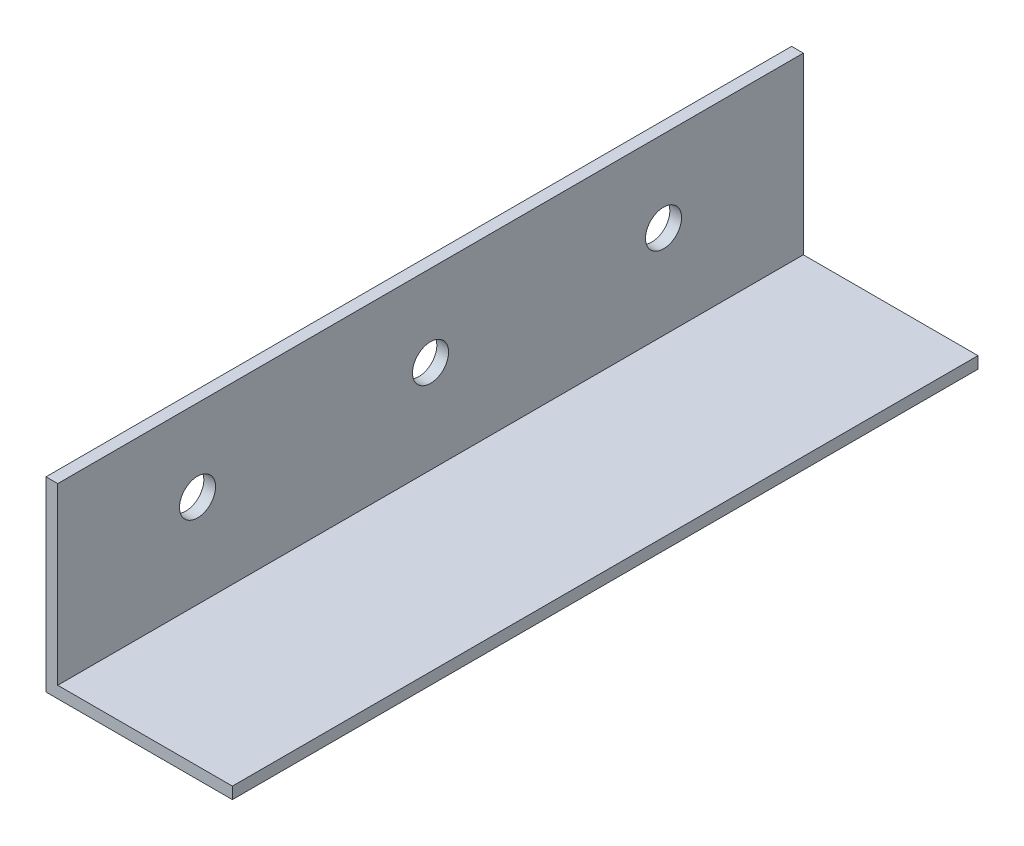
ISO-10303-21;
HEADER;
FILE_DESCRIPTION(('STEP AP214'),'2;1');
FILE_NAME('part.step','',(''),(''),'','','');
FILE_SCHEMA(('AUTOMOTIVE_DESIGN { 1 0 10303 214 1 1 1 1 }'));
ENDSEC;
DATA;
#1=APPLICATION_CONTEXT('core data for automotive mechanical design processes');
#2=APPLICATION_PROTOCOL_DEFINITION('international standard','automotive_design',2000,#1);
#3=PRODUCT_CONTEXT('',#1,'mechanical');
#4=PRODUCT('Part','Part','',(#3));
#5=PRODUCT_RELATED_PRODUCT_CATEGORY('part','',(#4));
#6=PRODUCT_DEFINITION_FORMATION('','',#4);
#7=PRODUCT_DEFINITION_CONTEXT('part definition',#1,'design');
#8=PRODUCT_DEFINITION('design','',#6,#7);
#9=PRODUCT_DEFINITION_SHAPE('','',#8);
#10=(LENGTH_UNIT() NAMED_UNIT(*) SI_UNIT(.MILLI.,.METRE.));
#11=(NAMED_UNIT(*) PLANE_ANGLE_UNIT() SI_UNIT($,.RADIAN.));
#12=(NAMED_UNIT(*) SI_UNIT($,.STERADIAN.) SOLID_ANGLE_UNIT());
#13=UNCERTAINTY_MEASURE_WITH_UNIT(LENGTH_MEASURE(1.E-05),#10,'distance_accuracy_value','');
#14=(GEOMETRIC_REPRESENTATION_CONTEXT(3) GLOBAL_UNCERTAINTY_ASSIGNED_CONTEXT((#13)) GLOBAL_UNIT_ASSIGNED_CONTEXT((#10,
#11,#12)) REPRESENTATION_CONTEXT('',''));
#15=CARTESIAN_POINT('',(0.,0.,0.));
#16=DIRECTION('',(0.,0.,1.));
#17=DIRECTION('',(1.,0.,0.));
#18=AXIS2_PLACEMENT_3D('',#15,#16,#17);
#19=CARTESIAN_POINT('',(0.,25.4,101.6));
#20=DIRECTION('',(0.,1.,0.));
#21=DIRECTION('',(0.,0.,1.));
#22=AXIS2_PLACEMENT_3D('',#19,#20,#21);
#23=PLANE('',#22);
#24=DIRECTION('',(1.,0.,0.));
#25=VECTOR('',#24,1.);
#26=CARTESIAN_POINT('',(0.,25.4,0.));
#27=LINE('',#26,#25);
#28=CARTESIAN_POINT('',(0.,25.4,0.));
#29=VERTEX_POINT('',#28);
#30=CARTESIAN_POINT('',(1.6002,25.4,0.));
#31=VERTEX_POINT('',#30);
#32=EDGE_CURVE('E117',#29,#31,#27,.T.);
#33=ORIENTED_EDGE('',*,*,#32,.F.);
#34=DIRECTION('',(0.,0.,-1.));
#35=VECTOR('',#34,1.);
#36=CARTESIAN_POINT('',(0.,25.4,101.6));
#37=LINE('',#36,#35);
#38=CARTESIAN_POINT('',(0.,25.4,101.6));
#39=VERTEX_POINT('',#38);
#40=EDGE_CURVE('E11',#39,#29,#37,.T.);
#41=ORIENTED_EDGE('',*,*,#40,.F.);
#42=DIRECTION('',(1.,0.,0.));
#43=VECTOR('',#42,1.);
#44=CARTESIAN_POINT('',(0.,25.4,101.6));
#45=LINE('',#44,#43);
#46=CARTESIAN_POINT('',(1.6002,25.4,101.6));
#47=VERTEX_POINT('',#46);
#48=EDGE_CURVE('E132',#39,#47,#45,.T.);
#49=ORIENTED_EDGE('',*,*,#48,.T.);
#50=DIRECTION('',(0.,0.,-1.));
#51=VECTOR('',#50,1.);
#52=CARTESIAN_POINT('',(1.6002,25.4,101.6));
#53=LINE('',#52,#51);
#54=EDGE_CURVE('E35',#47,#31,#53,.T.);
#55=ORIENTED_EDGE('',*,*,#54,.T.);
#56=EDGE_LOOP('',(#33,#41,#49,#55));
#57=FACE_BOUND('',#56,.T.);
#58=ADVANCED_FACE('F32',(#57),#23,.T.);
#59=CARTESIAN_POINT('',(0.,0.,101.6));
#60=DIRECTION('',(-1.,0.,0.));
#61=DIRECTION('',(0.,0.,1.));
#62=AXIS2_PLACEMENT_3D('',#59,#60,#61);
#63=PLANE('',#62);
#64=CARTESIAN_POINT('',(0.,14.2875,82.55));
#65=DIRECTION('',(1.,0.,0.));
#66=DIRECTION('',(0.,0.,-1.));
#67=AXIS2_PLACEMENT_3D('',#64,#65,#66);
#68=CIRCLE('',#67,2.45745);
#69=CARTESIAN_POINT('',(0.,14.2875,80.09255));
#70=VERTEX_POINT('',#69);
#71=EDGE_CURVE('E185',#70,#70,#68,.T.);
#72=ORIENTED_EDGE('',*,*,#71,.T.);
#73=EDGE_LOOP('',(#72));
#74=FACE_BOUND('',#73,.T.);
#75=CARTESIAN_POINT('',(0.,14.2875,50.8));
#76=DIRECTION('',(1.,0.,0.));
#77=DIRECTION('',(0.,0.,-1.));
#78=AXIS2_PLACEMENT_3D('',#75,#76,#77);
#79=CIRCLE('',#78,2.45745);
#80=CARTESIAN_POINT('',(0.,14.2875,48.34255));
#81=VERTEX_POINT('',#80);
#82=EDGE_CURVE('E176',#81,#81,#79,.T.);
#83=ORIENTED_EDGE('',*,*,#82,.T.);
#84=EDGE_LOOP('',(#83));
#85=FACE_BOUND('',#84,.T.);
#86=CARTESIAN_POINT('',(0.,14.2875,19.05));
#87=DIRECTION('',(1.,0.,0.));
#88=DIRECTION('',(0.,0.,-1.));
#89=AXIS2_PLACEMENT_3D('',#86,#87,#88);
#90=CIRCLE('',#89,2.45745);
#91=CARTESIAN_POINT('',(0.,14.2875,16.59255));
#92=VERTEX_POINT('',#91);
#93=EDGE_CURVE('E121',#92,#92,#90,.T.);
#94=ORIENTED_EDGE('',*,*,#93,.T.);
#95=EDGE_LOOP('',(#94));
#96=FACE_BOUND('',#95,.T.);
#97=DIRECTION('',(0.,1.,0.));
#98=VECTOR('',#97,1.);
#99=CARTESIAN_POINT('',(0.,0.,0.));
#100=LINE('',#99,#98);
#101=CARTESIAN_POINT('',(0.,0.,0.));
#102=VERTEX_POINT('',#101);
#103=EDGE_CURVE('E130',#102,#29,#100,.T.);
#104=ORIENTED_EDGE('',*,*,#103,.F.);
#105=DIRECTION('',(0.,0.,-1.));
#106=VECTOR('',#105,1.);
#107=CARTESIAN_POINT('',(0.,0.,101.6));
#108=LINE('',#107,#106);
#109=CARTESIAN_POINT('',(0.,0.,101.6));
#110=VERTEX_POINT('',#109);
#111=EDGE_CURVE('E41',#110,#102,#108,.T.);
#112=ORIENTED_EDGE('',*,*,#111,.F.);
#113=DIRECTION('',(0.,1.,0.));
#114=VECTOR('',#113,1.);
#115=CARTESIAN_POINT('',(0.,0.,101.6));
#116=LINE('',#115,#114);
#117=EDGE_CURVE('E107',#110,#39,#116,.T.);
#118=ORIENTED_EDGE('',*,*,#117,.T.);
#119=ORIENTED_EDGE('',*,*,#40,.T.);
#120=EDGE_LOOP('',(#104,#112,#118,#119));
#121=FACE_BOUND('',#120,.T.);
#122=ADVANCED_FACE('F140',(#74,#85,#96,#121),#63,.T.);
#123=CARTESIAN_POINT('',(25.4,0.,101.6));
#124=DIRECTION('',(0.,-1.,0.));
#125=DIRECTION('',(1.,0.,0.));
#126=AXIS2_PLACEMENT_3D('',#123,#124,#125);
#127=PLANE('',#126);
#128=DIRECTION('',(-1.,0.,0.));
#129=VECTOR('',#128,1.);
#130=CARTESIAN_POINT('',(25.4,0.,0.));
#131=LINE('',#130,#129);
#132=CARTESIAN_POINT('',(25.4,0.,0.));
#133=VERTEX_POINT('',#132);
#134=EDGE_CURVE('E94',#133,#102,#131,.T.);
#135=ORIENTED_EDGE('',*,*,#134,.F.);
#136=DIRECTION('',(0.,0.,-1.));
#137=VECTOR('',#136,1.);
#138=CARTESIAN_POINT('',(25.4,0.,101.6));
#139=LINE('',#138,#137);
#140=CARTESIAN_POINT('',(25.4,0.,101.6));
#141=VERTEX_POINT('',#140);
#142=EDGE_CURVE('E89',#141,#133,#139,.T.);
#143=ORIENTED_EDGE('',*,*,#142,.F.);
#144=DIRECTION('',(-1.,0.,0.));
#145=VECTOR('',#144,1.);
#146=CARTESIAN_POINT('',(25.4,0.,101.6));
#147=LINE('',#146,#145);
#148=EDGE_CURVE('E92',#141,#110,#147,.T.);
#149=ORIENTED_EDGE('',*,*,#148,.T.);
#150=ORIENTED_EDGE('',*,*,#111,.T.);
#151=EDGE_LOOP('',(#135,#143,#149,#150));
#152=FACE_BOUND('',#151,.T.);
#153=ADVANCED_FACE('F91',(#152),#127,.T.);
#154=CARTESIAN_POINT('',(25.4,1.6002,101.6));
#155=DIRECTION('',(1.,0.,0.));
#156=DIRECTION('',(0.,0.,-1.));
#157=AXIS2_PLACEMENT_3D('',#154,#155,#156);
#158=PLANE('',#157);
#159=DIRECTION('',(0.,-1.,0.));
#160=VECTOR('',#159,1.);
#161=CARTESIAN_POINT('',(25.4,1.6002,0.));
#162=LINE('',#161,#160);
#163=CARTESIAN_POINT('',(25.4,1.6002,0.));
#164=VERTEX_POINT('',#163);
#165=EDGE_CURVE('E127',#164,#133,#162,.T.);
#166=ORIENTED_EDGE('',*,*,#165,.F.);
#167=DIRECTION('',(0.,0.,-1.));
#168=VECTOR('',#167,1.);
#169=CARTESIAN_POINT('',(25.4,1.6002,101.6));
#170=LINE('',#169,#168);
#171=CARTESIAN_POINT('',(25.4,1.6002,101.6));
#172=VERTEX_POINT('',#171);
#173=EDGE_CURVE('E99',#172,#164,#170,.T.);
#174=ORIENTED_EDGE('',*,*,#173,.F.);
#175=DIRECTION('',(0.,-1.,0.));
#176=VECTOR('',#175,1.);
#177=CARTESIAN_POINT('',(25.4,1.6002,101.6));
#178=LINE('',#177,#176);
#179=EDGE_CURVE('E105',#172,#141,#178,.T.);
#180=ORIENTED_EDGE('',*,*,#179,.T.);
#181=ORIENTED_EDGE('',*,*,#142,.T.);
#182=EDGE_LOOP('',(#166,#174,#180,#181));
#183=FACE_BOUND('',#182,.T.);
#184=ADVANCED_FACE('F109',(#183),#158,.T.);
#185=CARTESIAN_POINT('',(1.6002,1.6002,101.6));
#186=DIRECTION('',(0.,1.,0.));
#187=DIRECTION('',(-1.,0.,0.));
#188=AXIS2_PLACEMENT_3D('',#185,#186,#187);
#189=PLANE('',#188);
#190=DIRECTION('',(1.,0.,0.));
#191=VECTOR('',#190,1.);
#192=CARTESIAN_POINT('',(1.6002,1.6002,0.));
#193=LINE('',#192,#191);
#194=CARTESIAN_POINT('',(1.6002,1.6002,0.));
#195=VERTEX_POINT('',#194);
#196=EDGE_CURVE('E124',#195,#164,#193,.T.);
#197=ORIENTED_EDGE('',*,*,#196,.F.);
#198=DIRECTION('',(0.,0.,-1.));
#199=VECTOR('',#198,1.);
#200=CARTESIAN_POINT('',(1.6002,1.6002,101.6));
#201=LINE('',#200,#199);
#202=CARTESIAN_POINT('',(1.6002,1.6002,101.6));
#203=VERTEX_POINT('',#202);
#204=EDGE_CURVE('E135',#203,#195,#201,.T.);
#205=ORIENTED_EDGE('',*,*,#204,.F.);
#206=DIRECTION('',(1.,0.,0.));
#207=VECTOR('',#206,1.);
#208=CARTESIAN_POINT('',(1.6002,1.6002,101.6));
#209=LINE('',#208,#207);
#210=EDGE_CURVE('E110',#203,#172,#209,.T.);
#211=ORIENTED_EDGE('',*,*,#210,.T.);
#212=ORIENTED_EDGE('',*,*,#173,.T.);
#213=EDGE_LOOP('',(#197,#205,#211,#212));
#214=FACE_BOUND('',#213,.T.);
#215=ADVANCED_FACE('F156',(#214),#189,.T.);
#216=CARTESIAN_POINT('',(1.6002,25.4,101.6));
#217=DIRECTION('',(1.,0.,0.));
#218=DIRECTION('',(0.,1.,0.));
#219=AXIS2_PLACEMENT_3D('',#216,#217,#218);
#220=PLANE('',#219);
#221=CARTESIAN_POINT('',(1.6002,14.2875,82.55));
#222=DIRECTION('',(1.,0.,0.));
#223=DIRECTION('',(0.,0.,-1.));
#224=AXIS2_PLACEMENT_3D('',#221,#222,#223);
#225=CIRCLE('',#224,2.45744999999999);
#226=CARTESIAN_POINT('',(1.6002,14.2875,80.09255));
#227=VERTEX_POINT('',#226);
#228=EDGE_CURVE('E167',#227,#227,#225,.T.);
#229=ORIENTED_EDGE('',*,*,#228,.F.);
#230=EDGE_LOOP('',(#229));
#231=FACE_BOUND('',#230,.T.);
#232=CARTESIAN_POINT('',(1.6002,14.2875,50.8));
#233=DIRECTION('',(1.,0.,0.));
#234=DIRECTION('',(0.,0.,-1.));
#235=AXIS2_PLACEMENT_3D('',#232,#233,#234);
#236=CIRCLE('',#235,2.45744999999999);
#237=CARTESIAN_POINT('',(1.6002,14.2875,48.34255));
#238=VERTEX_POINT('',#237);
#239=EDGE_CURVE('E171',#238,#238,#236,.T.);
#240=ORIENTED_EDGE('',*,*,#239,.F.);
#241=EDGE_LOOP('',(#240));
#242=FACE_BOUND('',#241,.T.);
#243=CARTESIAN_POINT('',(1.6002,14.2875,19.05));
#244=DIRECTION('',(1.,0.,0.));
#245=DIRECTION('',(0.,0.,-1.));
#246=AXIS2_PLACEMENT_3D('',#243,#244,#245);
#247=CIRCLE('',#246,2.45744999999999);
#248=CARTESIAN_POINT('',(1.6002,14.2875,16.59255));
#249=VERTEX_POINT('',#248);
#250=EDGE_CURVE('E174',#249,#249,#247,.T.);
#251=ORIENTED_EDGE('',*,*,#250,.F.);
#252=EDGE_LOOP('',(#251));
#253=FACE_BOUND('',#252,.T.);
#254=DIRECTION('',(0.,-1.,0.));
#255=VECTOR('',#254,1.);
#256=CARTESIAN_POINT('',(1.6002,25.4,0.));
#257=LINE('',#256,#255);
#258=EDGE_CURVE('E120',#31,#195,#257,.T.);
#259=ORIENTED_EDGE('',*,*,#258,.F.);
#260=ORIENTED_EDGE('',*,*,#54,.F.);
#261=DIRECTION('',(0.,-1.,0.));
#262=VECTOR('',#261,1.);
#263=CARTESIAN_POINT('',(1.6002,25.4,101.6));
#264=LINE('',#263,#262);
#265=EDGE_CURVE('E112',#47,#203,#264,.T.);
#266=ORIENTED_EDGE('',*,*,#265,.T.);
#267=ORIENTED_EDGE('',*,*,#204,.T.);
#268=EDGE_LOOP('',(#259,#260,#266,#267));
#269=FACE_BOUND('',#268,.T.);
#270=ADVANCED_FACE('F137',(#231,#242,#253,#269),#220,.T.);
#271=CARTESIAN_POINT('',(0.,0.,101.6));
#272=DIRECTION('',(0.,0.,-1.));
#273=DIRECTION('',(-1.,0.,0.));
#274=AXIS2_PLACEMENT_3D('',#271,#272,#273);
#275=PLANE('',#274);
#276=ORIENTED_EDGE('',*,*,#48,.F.);
#277=ORIENTED_EDGE('',*,*,#117,.F.);
#278=ORIENTED_EDGE('',*,*,#148,.F.);
#279=ORIENTED_EDGE('',*,*,#179,.F.);
#280=ORIENTED_EDGE('',*,*,#210,.F.);
#281=ORIENTED_EDGE('',*,*,#265,.F.);
#282=EDGE_LOOP('',(#276,#277,#278,#279,#280,#281));
#283=FACE_BOUND('',#282,.T.);
#284=ADVANCED_FACE('F103',(#283),#275,.F.);
#285=CARTESIAN_POINT('',(0.,0.,0.));
#286=DIRECTION('',(0.,0.,-1.));
#287=DIRECTION('',(-1.,0.,0.));
#288=AXIS2_PLACEMENT_3D('',#285,#286,#287);
#289=PLANE('',#288);
#290=ORIENTED_EDGE('',*,*,#32,.T.);
#291=ORIENTED_EDGE('',*,*,#258,.T.);
#292=ORIENTED_EDGE('',*,*,#196,.T.);
#293=ORIENTED_EDGE('',*,*,#165,.T.);
#294=ORIENTED_EDGE('',*,*,#134,.T.);
#295=ORIENTED_EDGE('',*,*,#103,.T.);
#296=EDGE_LOOP('',(#290,#291,#292,#293,#294,#295));
#297=FACE_BOUND('',#296,.T.);
#298=ADVANCED_FACE('F139',(#297),#289,.T.);
#299=CARTESIAN_POINT('',(1.6002,14.2875,19.05));
#300=DIRECTION('',(1.,0.,0.));
#301=DIRECTION('',(0.,0.,-1.));
#302=AXIS2_PLACEMENT_3D('',#299,#300,#301);
#303=CYLINDRICAL_SURFACE('',#302,2.45744999999999);
#304=ORIENTED_EDGE('',*,*,#93,.F.);
#305=EDGE_LOOP('',(#304));
#306=FACE_BOUND('',#305,.T.);
#307=ORIENTED_EDGE('',*,*,#250,.T.);
#308=EDGE_LOOP('',(#307));
#309=FACE_BOUND('',#308,.T.);
#310=ADVANCED_FACE('F196',(#306,#309),#303,.F.);
#311=CARTESIAN_POINT('',(1.6002,14.2875,50.8));
#312=DIRECTION('',(1.,0.,0.));
#313=DIRECTION('',(0.,0.,-1.));
#314=AXIS2_PLACEMENT_3D('',#311,#312,#313);
#315=CYLINDRICAL_SURFACE('',#314,2.45744999999999);
#316=ORIENTED_EDGE('',*,*,#82,.F.);
#317=EDGE_LOOP('',(#316));
#318=FACE_BOUND('',#317,.T.);
#319=ORIENTED_EDGE('',*,*,#239,.T.);
#320=EDGE_LOOP('',(#319));
#321=FACE_BOUND('',#320,.T.);
#322=ADVANCED_FACE('F190',(#318,#321),#315,.F.);
#323=CARTESIAN_POINT('',(1.6002,14.2875,82.55));
#324=DIRECTION('',(1.,0.,0.));
#325=DIRECTION('',(0.,0.,-1.));
#326=AXIS2_PLACEMENT_3D('',#323,#324,#325);
#327=CYLINDRICAL_SURFACE('',#326,2.45744999999999);
#328=ORIENTED_EDGE('',*,*,#71,.F.);
#329=EDGE_LOOP('',(#328));
#330=FACE_BOUND('',#329,.T.);
#331=ORIENTED_EDGE('',*,*,#228,.T.);
#332=EDGE_LOOP('',(#331));
#333=FACE_BOUND('',#332,.T.);
#334=ADVANCED_FACE('F188',(#330,#333),#327,.F.);
#335=CLOSED_SHELL('',(#58,#122,#153,#184,#215,#270,#284,#298,#310,#322,#334));
#336=MANIFOLD_SOLID_BREP('B2',#335);
#337=ADVANCED_BREP_SHAPE_REPRESENTATION('',(#18,#336),#14);
#338=SHAPE_DEFINITION_REPRESENTATION(#9,#337);
ENDSEC;
END-ISO-10303-21;
